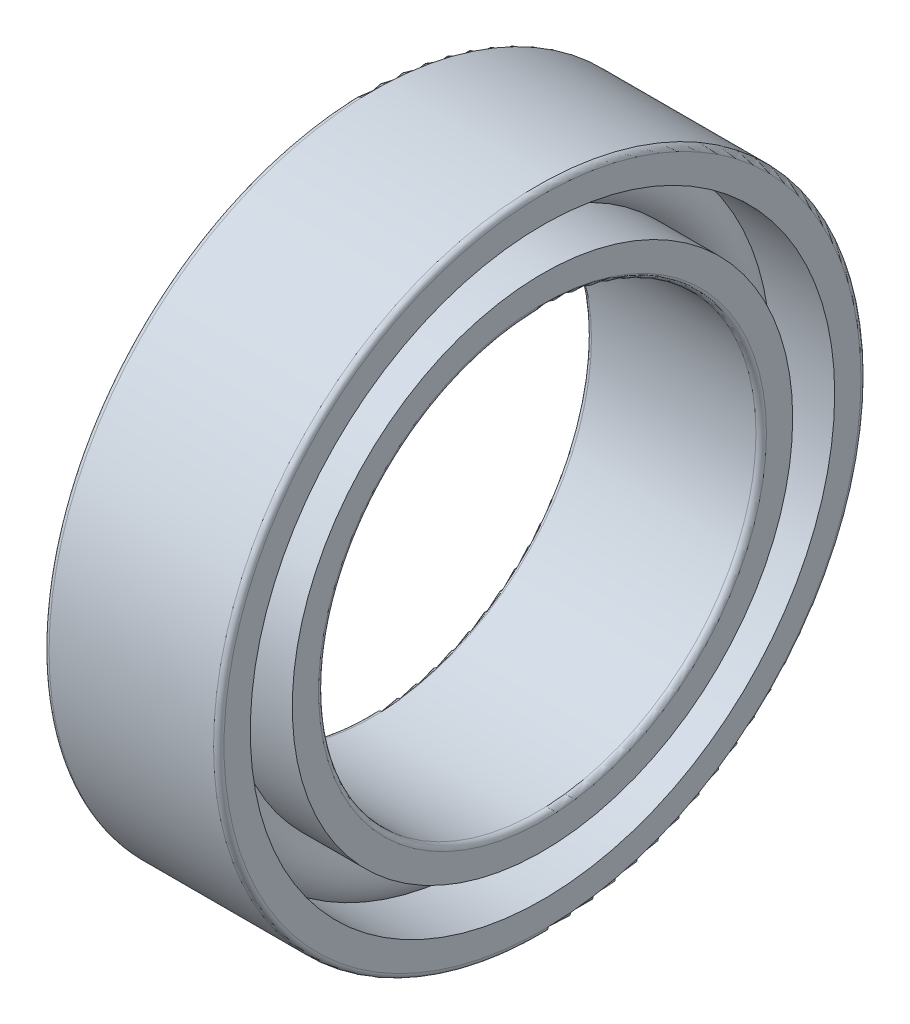
ISO-10303-21;
HEADER;
FILE_DESCRIPTION(('STEP AP214'),'2;1');
FILE_NAME('part.step','',(''),(''),'','','');
FILE_SCHEMA(('AUTOMOTIVE_DESIGN { 1 0 10303 214 1 1 1 1 }'));
ENDSEC;
DATA;
#1=APPLICATION_CONTEXT('core data for automotive mechanical design processes');
#2=APPLICATION_PROTOCOL_DEFINITION('international standard','automotive_design',2000,#1);
#3=PRODUCT_CONTEXT('',#1,'mechanical');
#4=PRODUCT('Part','Part','',(#3));
#5=PRODUCT_RELATED_PRODUCT_CATEGORY('part','',(#4));
#6=PRODUCT_DEFINITION_FORMATION('','',#4);
#7=PRODUCT_DEFINITION_CONTEXT('part definition',#1,'design');
#8=PRODUCT_DEFINITION('design','',#6,#7);
#9=PRODUCT_DEFINITION_SHAPE('','',#8);
#10=(LENGTH_UNIT() NAMED_UNIT(*) SI_UNIT(.MILLI.,.METRE.));
#11=(NAMED_UNIT(*) PLANE_ANGLE_UNIT() SI_UNIT($,.RADIAN.));
#12=(NAMED_UNIT(*) SI_UNIT($,.STERADIAN.) SOLID_ANGLE_UNIT());
#13=UNCERTAINTY_MEASURE_WITH_UNIT(LENGTH_MEASURE(1.E-05),#10,'distance_accuracy_value','');
#14=(GEOMETRIC_REPRESENTATION_CONTEXT(3) GLOBAL_UNCERTAINTY_ASSIGNED_CONTEXT((#13)) GLOBAL_UNIT_ASSIGNED_CONTEXT((#10,
#11,#12)) REPRESENTATION_CONTEXT('',''));
#15=CARTESIAN_POINT('',(0.,0.,0.));
#16=DIRECTION('',(0.,0.,1.));
#17=DIRECTION('',(1.,0.,0.));
#18=AXIS2_PLACEMENT_3D('',#15,#16,#17);
#19=CARTESIAN_POINT('',(0.,0.,0.));
#20=DIRECTION('',(-1.,0.,0.));
#21=DIRECTION('',(0.,0.,1.));
#22=AXIS2_PLACEMENT_3D('',#19,#20,#21);
#23=TOROIDAL_SURFACE('',#22,15.5,1.8);
#24=CARTESIAN_POINT('',(1.34164078649987,0.,0.));
#25=DIRECTION('',(-1.,0.,0.));
#26=DIRECTION('',(0.,0.,1.));
#27=AXIS2_PLACEMENT_3D('',#24,#25,#26);
#28=CIRCLE('',#27,16.7);
#29=CARTESIAN_POINT('',(1.34164078649987,0.,16.7));
#30=VERTEX_POINT('',#29);
#31=EDGE_CURVE('E36',#30,#30,#28,.F.);
#32=ORIENTED_EDGE('',*,*,#31,.T.);
#33=EDGE_LOOP('',(#32));
#34=FACE_BOUND('',#33,.T.);
#35=CARTESIAN_POINT('',(1.34164078649987,0.,0.));
#36=DIRECTION('',(-1.,0.,0.));
#37=DIRECTION('',(0.,0.,1.));
#38=AXIS2_PLACEMENT_3D('',#35,#36,#37);
#39=CIRCLE('',#38,14.3);
#40=CARTESIAN_POINT('',(1.34164078649987,0.,14.3));
#41=VERTEX_POINT('',#40);
#42=EDGE_CURVE('E10',#41,#41,#39,.T.);
#43=ORIENTED_EDGE('',*,*,#42,.T.);
#44=EDGE_LOOP('',(#43));
#45=FACE_BOUND('',#44,.T.);
#46=ADVANCED_FACE('F32',(#34,#45),#23,.T.);
#47=CARTESIAN_POINT('',(-20.6375,0.,0.));
#48=DIRECTION('',(1.,0.,0.));
#49=DIRECTION('',(0.,0.,-1.));
#50=AXIS2_PLACEMENT_3D('',#47,#48,#49);
#51=CYLINDRICAL_SURFACE('',#50,14.3);
#52=CARTESIAN_POINT('',(5.,0.,0.));
#53=DIRECTION('',(1.,0.,0.));
#54=DIRECTION('',(0.,0.,-1.));
#55=AXIS2_PLACEMENT_3D('',#52,#53,#54);
#56=CIRCLE('',#55,14.3);
#57=CARTESIAN_POINT('',(5.,0.,-14.3));
#58=VERTEX_POINT('',#57);
#59=EDGE_CURVE('E45',#58,#58,#56,.T.);
#60=ORIENTED_EDGE('',*,*,#59,.F.);
#61=EDGE_LOOP('',(#60));
#62=FACE_BOUND('',#61,.T.);
#63=ORIENTED_EDGE('',*,*,#42,.F.);
#64=EDGE_LOOP('',(#63));
#65=FACE_BOUND('',#64,.T.);
#66=ADVANCED_FACE('F84',(#62,#65),#51,.T.);
#67=CARTESIAN_POINT('',(-20.6375,0.,0.));
#68=DIRECTION('',(1.,0.,0.));
#69=DIRECTION('',(0.,0.,-1.));
#70=AXIS2_PLACEMENT_3D('',#67,#68,#69);
#71=CYLINDRICAL_SURFACE('',#70,14.3);
#72=CARTESIAN_POINT('',(-5.,0.,0.));
#73=DIRECTION('',(1.,0.,0.));
#74=DIRECTION('',(0.,0.,-1.));
#75=AXIS2_PLACEMENT_3D('',#72,#73,#74);
#76=CIRCLE('',#75,14.3);
#77=CARTESIAN_POINT('',(-5.,0.,-14.3));
#78=VERTEX_POINT('',#77);
#79=EDGE_CURVE('E54',#78,#78,#76,.T.);
#80=ORIENTED_EDGE('',*,*,#79,.T.);
#81=EDGE_LOOP('',(#80));
#82=FACE_BOUND('',#81,.T.);
#83=CARTESIAN_POINT('',(-1.34164078649987,0.,0.));
#84=DIRECTION('',(1.,0.,0.));
#85=DIRECTION('',(0.,0.,-1.));
#86=AXIS2_PLACEMENT_3D('',#83,#84,#85);
#87=CIRCLE('',#86,14.3);
#88=CARTESIAN_POINT('',(-1.34164078649987,0.,-14.3));
#89=VERTEX_POINT('',#88);
#90=EDGE_CURVE('E40',#89,#89,#87,.T.);
#91=ORIENTED_EDGE('',*,*,#90,.F.);
#92=EDGE_LOOP('',(#91));
#93=FACE_BOUND('',#92,.T.);
#94=ADVANCED_FACE('F87',(#82,#93),#71,.T.);
#95=CARTESIAN_POINT('',(5.,12.8,0.));
#96=DIRECTION('',(1.,0.,0.));
#97=DIRECTION('',(0.,0.,-1.));
#98=AXIS2_PLACEMENT_3D('',#95,#96,#97);
#99=PLANE('',#98);
#100=ORIENTED_EDGE('',*,*,#59,.T.);
#101=EDGE_LOOP('',(#100));
#102=FACE_BOUND('',#101,.T.);
#103=CARTESIAN_POINT('',(5.,0.,0.));
#104=DIRECTION('',(1.,0.,0.));
#105=DIRECTION('',(0.,0.,-1.));
#106=AXIS2_PLACEMENT_3D('',#103,#104,#105);
#107=CIRCLE('',#106,12.8);
#108=CARTESIAN_POINT('',(5.,0.,-12.8));
#109=VERTEX_POINT('',#108);
#110=EDGE_CURVE('E76',#109,#109,#107,.T.);
#111=ORIENTED_EDGE('',*,*,#110,.F.);
#112=EDGE_LOOP('',(#111));
#113=FACE_BOUND('',#112,.T.);
#114=ADVANCED_FACE('F81',(#102,#113),#99,.T.);
#115=CARTESIAN_POINT('',(4.7,0.,0.));
#116=DIRECTION('',(1.,0.,0.));
#117=DIRECTION('',(0.,0.,-1.));
#118=AXIS2_PLACEMENT_3D('',#115,#116,#117);
#119=TOROIDAL_SURFACE('',#118,12.8,0.3);
#120=ORIENTED_EDGE('',*,*,#110,.T.);
#121=EDGE_LOOP('',(#120));
#122=FACE_BOUND('',#121,.T.);
#123=CARTESIAN_POINT('',(4.7,0.,0.));
#124=DIRECTION('',(1.,0.,0.));
#125=DIRECTION('',(0.,0.,-1.));
#126=AXIS2_PLACEMENT_3D('',#123,#124,#125);
#127=CIRCLE('',#126,12.5);
#128=CARTESIAN_POINT('',(4.7,0.,-12.5));
#129=VERTEX_POINT('',#128);
#130=EDGE_CURVE('E73',#129,#129,#127,.T.);
#131=ORIENTED_EDGE('',*,*,#130,.F.);
#132=EDGE_LOOP('',(#131));
#133=FACE_BOUND('',#132,.T.);
#134=ADVANCED_FACE('F98',(#122,#133),#119,.T.);
#135=CARTESIAN_POINT('',(-20.6375,0.,0.));
#136=DIRECTION('',(1.,0.,0.));
#137=DIRECTION('',(0.,0.,-1.));
#138=AXIS2_PLACEMENT_3D('',#135,#136,#137);
#139=CYLINDRICAL_SURFACE('',#138,12.5);
#140=ORIENTED_EDGE('',*,*,#130,.T.);
#141=EDGE_LOOP('',(#140));
#142=FACE_BOUND('',#141,.T.);
#143=CARTESIAN_POINT('',(-4.7,0.,0.));
#144=DIRECTION('',(1.,0.,0.));
#145=DIRECTION('',(0.,0.,-1.));
#146=AXIS2_PLACEMENT_3D('',#143,#144,#145);
#147=CIRCLE('',#146,12.5);
#148=CARTESIAN_POINT('',(-4.7,0.,-12.5));
#149=VERTEX_POINT('',#148);
#150=EDGE_CURVE('E70',#149,#149,#147,.T.);
#151=ORIENTED_EDGE('',*,*,#150,.F.);
#152=EDGE_LOOP('',(#151));
#153=FACE_BOUND('',#152,.T.);
#154=ADVANCED_FACE('F101',(#142,#153),#139,.F.);
#155=CARTESIAN_POINT('',(-4.7,0.,0.));
#156=DIRECTION('',(1.,0.,0.));
#157=DIRECTION('',(0.,0.,-1.));
#158=AXIS2_PLACEMENT_3D('',#155,#156,#157);
#159=TOROIDAL_SURFACE('',#158,12.8,0.3);
#160=ORIENTED_EDGE('',*,*,#150,.T.);
#161=EDGE_LOOP('',(#160));
#162=FACE_BOUND('',#161,.T.);
#163=CARTESIAN_POINT('',(-5.,0.,0.));
#164=DIRECTION('',(1.,0.,0.));
#165=DIRECTION('',(0.,0.,-1.));
#166=AXIS2_PLACEMENT_3D('',#163,#164,#165);
#167=CIRCLE('',#166,12.8);
#168=CARTESIAN_POINT('',(-5.,0.,-12.8));
#169=VERTEX_POINT('',#168);
#170=EDGE_CURVE('E67',#169,#169,#167,.T.);
#171=ORIENTED_EDGE('',*,*,#170,.F.);
#172=EDGE_LOOP('',(#171));
#173=FACE_BOUND('',#172,.T.);
#174=ADVANCED_FACE('F105',(#162,#173),#159,.T.);
#175=CARTESIAN_POINT('',(-5.,14.3,0.));
#176=DIRECTION('',(-1.,0.,0.));
#177=DIRECTION('',(0.,0.,1.));
#178=AXIS2_PLACEMENT_3D('',#175,#176,#177);
#179=PLANE('',#178);
#180=ORIENTED_EDGE('',*,*,#170,.T.);
#181=EDGE_LOOP('',(#180));
#182=FACE_BOUND('',#181,.T.);
#183=ORIENTED_EDGE('',*,*,#79,.F.);
#184=EDGE_LOOP('',(#183));
#185=FACE_BOUND('',#184,.T.);
#186=ADVANCED_FACE('F109',(#182,#185),#179,.T.);
#187=CARTESIAN_POINT('',(-1.34164078649987,0.,0.));
#188=DIRECTION('',(1.,0.,0.));
#189=DIRECTION('',(0.,0.,-1.));
#190=AXIS2_PLACEMENT_3D('',#187,#188,#189);
#191=CIRCLE('',#190,16.7);
#192=CARTESIAN_POINT('',(-1.34164078649987,0.,-16.7));
#193=VERTEX_POINT('',#192);
#194=EDGE_CURVE('E48',#193,#193,#191,.F.);
#195=ORIENTED_EDGE('',*,*,#194,.T.);
#196=EDGE_LOOP('',(#195));
#197=FACE_BOUND('',#196,.T.);
#198=ORIENTED_EDGE('',*,*,#90,.T.);
#199=EDGE_LOOP('',(#198));
#200=FACE_BOUND('',#199,.T.);
#201=ADVANCED_FACE('F34',(#197,#200),#23,.T.);
#202=CARTESIAN_POINT('',(-20.6375,0.,0.));
#203=DIRECTION('',(1.,0.,0.));
#204=DIRECTION('',(0.,0.,-1.));
#205=AXIS2_PLACEMENT_3D('',#202,#203,#204);
#206=CYLINDRICAL_SURFACE('',#205,16.7);
#207=CARTESIAN_POINT('',(5.,0.,0.));
#208=DIRECTION('',(1.,0.,0.));
#209=DIRECTION('',(0.,0.,-1.));
#210=AXIS2_PLACEMENT_3D('',#207,#208,#209);
#211=CIRCLE('',#210,16.7);
#212=CARTESIAN_POINT('',(5.,0.,-16.7));
#213=VERTEX_POINT('',#212);
#214=EDGE_CURVE('E50',#213,#213,#211,.T.);
#215=ORIENTED_EDGE('',*,*,#214,.T.);
#216=EDGE_LOOP('',(#215));
#217=FACE_BOUND('',#216,.T.);
#218=ORIENTED_EDGE('',*,*,#31,.F.);
#219=EDGE_LOOP('',(#218));
#220=FACE_BOUND('',#219,.T.);
#221=ADVANCED_FACE('F114',(#217,#220),#206,.F.);
#222=CARTESIAN_POINT('',(-20.6375,0.,0.));
#223=DIRECTION('',(1.,0.,0.));
#224=DIRECTION('',(0.,0.,-1.));
#225=AXIS2_PLACEMENT_3D('',#222,#223,#224);
#226=CYLINDRICAL_SURFACE('',#225,16.7);
#227=CARTESIAN_POINT('',(-5.,0.,0.));
#228=DIRECTION('',(1.,0.,0.));
#229=DIRECTION('',(0.,0.,-1.));
#230=AXIS2_PLACEMENT_3D('',#227,#228,#229);
#231=CIRCLE('',#230,16.7);
#232=CARTESIAN_POINT('',(-5.,0.,-16.7));
#233=VERTEX_POINT('',#232);
#234=EDGE_CURVE('E145',#233,#233,#231,.T.);
#235=ORIENTED_EDGE('',*,*,#234,.F.);
#236=EDGE_LOOP('',(#235));
#237=FACE_BOUND('',#236,.T.);
#238=ORIENTED_EDGE('',*,*,#194,.F.);
#239=EDGE_LOOP('',(#238));
#240=FACE_BOUND('',#239,.T.);
#241=ADVANCED_FACE('F117',(#237,#240),#226,.F.);
#242=CARTESIAN_POINT('',(5.,18.2,0.));
#243=DIRECTION('',(1.,0.,0.));
#244=DIRECTION('',(0.,0.,-1.));
#245=AXIS2_PLACEMENT_3D('',#242,#243,#244);
#246=PLANE('',#245);
#247=CARTESIAN_POINT('',(5.,0.,0.));
#248=DIRECTION('',(1.,0.,0.));
#249=DIRECTION('',(0.,0.,-1.));
#250=AXIS2_PLACEMENT_3D('',#247,#248,#249);
#251=CIRCLE('',#250,18.2);
#252=CARTESIAN_POINT('',(5.,0.,-18.2));
#253=VERTEX_POINT('',#252);
#254=EDGE_CURVE('E56',#253,#253,#251,.T.);
#255=ORIENTED_EDGE('',*,*,#254,.T.);
#256=EDGE_LOOP('',(#255));
#257=FACE_BOUND('',#256,.T.);
#258=ORIENTED_EDGE('',*,*,#214,.F.);
#259=EDGE_LOOP('',(#258));
#260=FACE_BOUND('',#259,.T.);
#261=ADVANCED_FACE('F118',(#257,#260),#246,.T.);
#262=CARTESIAN_POINT('',(4.7,0.,0.));
#263=DIRECTION('',(1.,0.,0.));
#264=DIRECTION('',(0.,0.,-1.));
#265=AXIS2_PLACEMENT_3D('',#262,#263,#264);
#266=TOROIDAL_SURFACE('',#265,18.2,0.299999999999999);
#267=CARTESIAN_POINT('',(4.7,0.,0.));
#268=DIRECTION('',(1.,0.,0.));
#269=DIRECTION('',(0.,0.,-1.));
#270=AXIS2_PLACEMENT_3D('',#267,#268,#269);
#271=CIRCLE('',#270,18.5);
#272=CARTESIAN_POINT('',(4.7,0.,-18.5));
#273=VERTEX_POINT('',#272);
#274=EDGE_CURVE('E61',#273,#273,#271,.T.);
#275=ORIENTED_EDGE('',*,*,#274,.T.);
#276=EDGE_LOOP('',(#275));
#277=FACE_BOUND('',#276,.T.);
#278=ORIENTED_EDGE('',*,*,#254,.F.);
#279=EDGE_LOOP('',(#278));
#280=FACE_BOUND('',#279,.T.);
#281=ADVANCED_FACE('F121',(#277,#280),#266,.T.);
#282=CARTESIAN_POINT('',(-20.6375,0.,0.));
#283=DIRECTION('',(1.,0.,0.));
#284=DIRECTION('',(0.,0.,-1.));
#285=AXIS2_PLACEMENT_3D('',#282,#283,#284);
#286=CYLINDRICAL_SURFACE('',#285,18.5);
#287=CARTESIAN_POINT('',(-4.7,0.,0.));
#288=DIRECTION('',(1.,0.,0.));
#289=DIRECTION('',(0.,0.,-1.));
#290=AXIS2_PLACEMENT_3D('',#287,#288,#289);
#291=CIRCLE('',#290,18.5);
#292=CARTESIAN_POINT('',(-4.7,0.,-18.5));
#293=VERTEX_POINT('',#292);
#294=EDGE_CURVE('E149',#293,#293,#291,.T.);
#295=ORIENTED_EDGE('',*,*,#294,.T.);
#296=EDGE_LOOP('',(#295));
#297=FACE_BOUND('',#296,.T.);
#298=ORIENTED_EDGE('',*,*,#274,.F.);
#299=EDGE_LOOP('',(#298));
#300=FACE_BOUND('',#299,.T.);
#301=ADVANCED_FACE('F125',(#297,#300),#286,.T.);
#302=CARTESIAN_POINT('',(-4.7,0.,0.));
#303=DIRECTION('',(1.,0.,0.));
#304=DIRECTION('',(0.,0.,-1.));
#305=AXIS2_PLACEMENT_3D('',#302,#303,#304);
#306=TOROIDAL_SURFACE('',#305,18.2,0.299999999999999);
#307=CARTESIAN_POINT('',(-5.,0.,0.));
#308=DIRECTION('',(1.,0.,0.));
#309=DIRECTION('',(0.,0.,-1.));
#310=AXIS2_PLACEMENT_3D('',#307,#308,#309);
#311=CIRCLE('',#310,18.2);
#312=CARTESIAN_POINT('',(-5.,0.,-18.2));
#313=VERTEX_POINT('',#312);
#314=EDGE_CURVE('E146',#313,#313,#311,.T.);
#315=ORIENTED_EDGE('',*,*,#314,.T.);
#316=EDGE_LOOP('',(#315));
#317=FACE_BOUND('',#316,.T.);
#318=ORIENTED_EDGE('',*,*,#294,.F.);
#319=EDGE_LOOP('',(#318));
#320=FACE_BOUND('',#319,.T.);
#321=ADVANCED_FACE('F129',(#317,#320),#306,.T.);
#322=CARTESIAN_POINT('',(-5.,16.7,0.));
#323=DIRECTION('',(-1.,0.,0.));
#324=DIRECTION('',(0.,0.,1.));
#325=AXIS2_PLACEMENT_3D('',#322,#323,#324);
#326=PLANE('',#325);
#327=ORIENTED_EDGE('',*,*,#234,.T.);
#328=EDGE_LOOP('',(#327));
#329=FACE_BOUND('',#328,.T.);
#330=ORIENTED_EDGE('',*,*,#314,.F.);
#331=EDGE_LOOP('',(#330));
#332=FACE_BOUND('',#331,.T.);
#333=ADVANCED_FACE('F133',(#329,#332),#326,.T.);
#334=CLOSED_SHELL('',(#46,#66,#94,#114,#134,#154,#174,#186,#201,#221,#241,#261,#281,#301,#321,#333));
#335=MANIFOLD_SOLID_BREP('B2',#334);
#336=ADVANCED_BREP_SHAPE_REPRESENTATION('',(#18,#335),#14);
#337=SHAPE_DEFINITION_REPRESENTATION(#9,#336);
ENDSEC;
END-ISO-10303-21;
